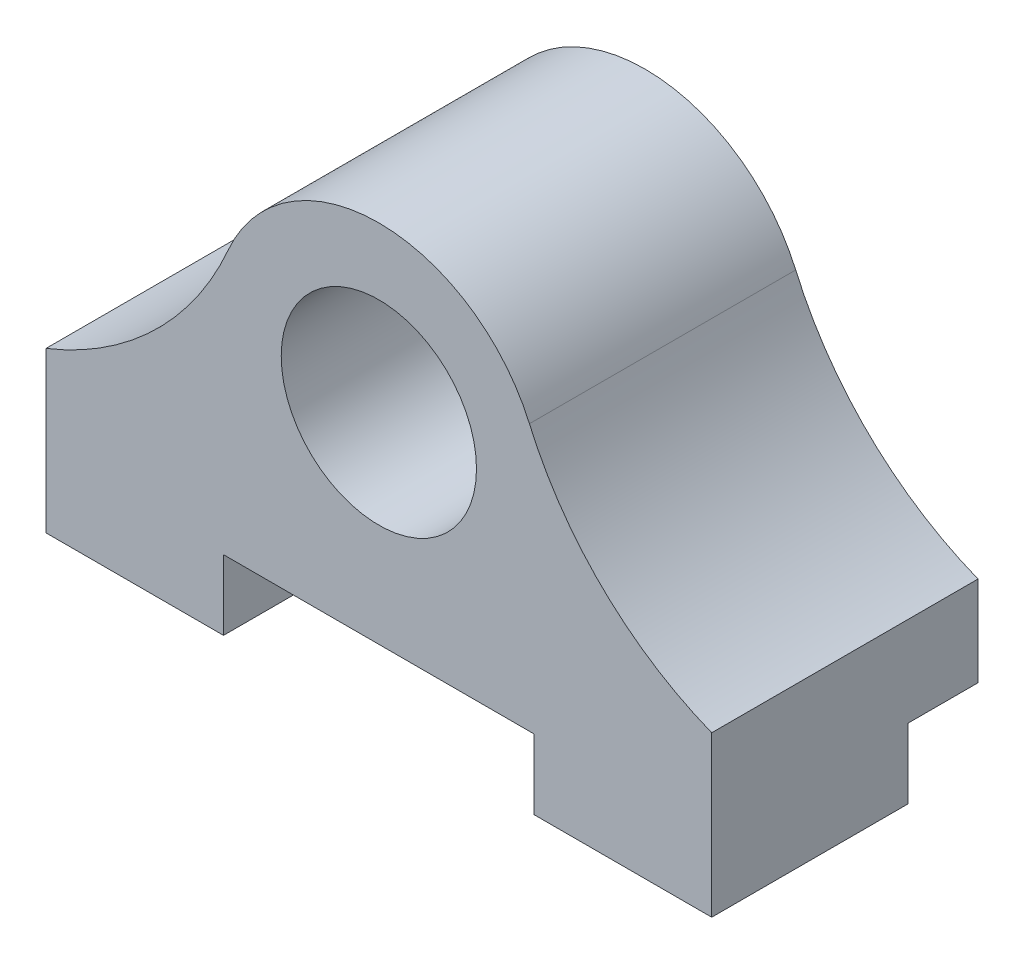
ISO-10303-21;
HEADER;
FILE_DESCRIPTION(('STEP AP214'),'2;1');
FILE_NAME('part.step','',(''),(''),'','','');
FILE_SCHEMA(('AUTOMOTIVE_DESIGN { 1 0 10303 214 1 1 1 1 }'));
ENDSEC;
DATA;
#1=APPLICATION_CONTEXT('core data for automotive mechanical design processes');
#2=APPLICATION_PROTOCOL_DEFINITION('international standard','automotive_design',2000,#1);
#3=PRODUCT_CONTEXT('',#1,'mechanical');
#4=PRODUCT('Part','Part','',(#3));
#5=PRODUCT_RELATED_PRODUCT_CATEGORY('part','',(#4));
#6=PRODUCT_DEFINITION_FORMATION('','',#4);
#7=PRODUCT_DEFINITION_CONTEXT('part definition',#1,'design');
#8=PRODUCT_DEFINITION('design','',#6,#7);
#9=PRODUCT_DEFINITION_SHAPE('','',#8);
#10=(LENGTH_UNIT() NAMED_UNIT(*) SI_UNIT(.MILLI.,.METRE.));
#11=(NAMED_UNIT(*) PLANE_ANGLE_UNIT() SI_UNIT($,.RADIAN.));
#12=(NAMED_UNIT(*) SI_UNIT($,.STERADIAN.) SOLID_ANGLE_UNIT());
#13=UNCERTAINTY_MEASURE_WITH_UNIT(LENGTH_MEASURE(1.E-05),#10,'distance_accuracy_value','');
#14=(GEOMETRIC_REPRESENTATION_CONTEXT(3) GLOBAL_UNCERTAINTY_ASSIGNED_CONTEXT((#13)) GLOBAL_UNIT_ASSIGNED_CONTEXT((#10,
#11,#12)) REPRESENTATION_CONTEXT('',''));
#15=CARTESIAN_POINT('',(0.,0.,0.));
#16=DIRECTION('',(0.,0.,1.));
#17=DIRECTION('',(1.,0.,0.));
#18=AXIS2_PLACEMENT_3D('',#15,#16,#17);
#19=CARTESIAN_POINT('',(0.,-12.2,0.));
#20=DIRECTION('',(0.,-1.,0.));
#21=DIRECTION('',(0.,0.,-1.));
#22=AXIS2_PLACEMENT_3D('',#19,#20,#21);
#23=PLANE('',#22);
#24=DIRECTION('',(0.,0.,1.));
#25=VECTOR('',#24,1.);
#26=CARTESIAN_POINT('',(6.99999999999999,-12.2,-2.));
#27=LINE('',#26,#25);
#28=CARTESIAN_POINT('',(6.99999999999999,-12.2,1.15));
#29=VERTEX_POINT('',#28);
#30=CARTESIAN_POINT('',(6.99999999999999,-12.2,10.));
#31=VERTEX_POINT('',#30);
#32=EDGE_CURVE('E139',#29,#31,#27,.T.);
#33=ORIENTED_EDGE('',*,*,#32,.F.);
#34=DIRECTION('',(-1.,0.,0.));
#35=VECTOR('',#34,1.);
#36=CARTESIAN_POINT('',(15.,-12.2,1.15));
#37=LINE('',#36,#35);
#38=CARTESIAN_POINT('',(15.,-12.2,1.15));
#39=VERTEX_POINT('',#38);
#40=EDGE_CURVE('E160',#39,#29,#37,.T.);
#41=ORIENTED_EDGE('',*,*,#40,.F.);
#42=DIRECTION('',(0.,0.,1.));
#43=VECTOR('',#42,1.);
#44=CARTESIAN_POINT('',(15.,-12.2,10.));
#45=LINE('',#44,#43);
#46=CARTESIAN_POINT('',(15.,-12.2,10.));
#47=VERTEX_POINT('',#46);
#48=EDGE_CURVE('E190',#39,#47,#45,.T.);
#49=ORIENTED_EDGE('',*,*,#48,.T.);
#50=DIRECTION('',(-1.,0.,0.));
#51=VECTOR('',#50,1.);
#52=CARTESIAN_POINT('',(-15.,-12.2,10.));
#53=LINE('',#52,#51);
#54=EDGE_CURVE('E192',#47,#31,#53,.T.);
#55=ORIENTED_EDGE('',*,*,#54,.T.);
#56=EDGE_LOOP('',(#33,#41,#49,#55));
#57=FACE_BOUND('',#56,.T.);
#58=CARTESIAN_POINT('',(11.5,-12.2,4.));
#59=DIRECTION('',(0.,-1.,0.));
#60=DIRECTION('',(0.,0.,-1.));
#61=AXIS2_PLACEMENT_3D('',#58,#59,#60);
#62=CIRCLE('',#61,1.65);
#63=CARTESIAN_POINT('',(11.5,-12.2,2.35));
#64=VERTEX_POINT('',#63);
#65=EDGE_CURVE('E183',#64,#64,#62,.T.);
#66=ORIENTED_EDGE('',*,*,#65,.F.);
#67=EDGE_LOOP('',(#66));
#68=FACE_BOUND('',#67,.T.);
#69=ADVANCED_FACE('F41',(#57,#68),#23,.T.);
#70=CARTESIAN_POINT('',(0.,0.,1.15));
#71=DIRECTION('',(0.,0.,1.));
#72=DIRECTION('',(1.,0.,0.));
#73=AXIS2_PLACEMENT_3D('',#70,#71,#72);
#74=PLANE('',#73);
#75=ORIENTED_EDGE('',*,*,#40,.T.);
#76=DIRECTION('',(0.,1.,0.));
#77=VECTOR('',#76,1.);
#78=CARTESIAN_POINT('',(6.99999999999999,0.,1.15));
#79=LINE('',#78,#77);
#80=CARTESIAN_POINT('',(6.99999999999999,-9.05,1.15));
#81=VERTEX_POINT('',#80);
#82=EDGE_CURVE('E11',#29,#81,#79,.T.);
#83=ORIENTED_EDGE('',*,*,#82,.T.);
#84=DIRECTION('',(1.,0.,0.));
#85=VECTOR('',#84,1.);
#86=CARTESIAN_POINT('',(15.,-9.05,1.15));
#87=LINE('',#86,#85);
#88=CARTESIAN_POINT('',(15.,-9.05,1.15));
#89=VERTEX_POINT('',#88);
#90=EDGE_CURVE('E164',#81,#89,#87,.T.);
#91=ORIENTED_EDGE('',*,*,#90,.T.);
#92=DIRECTION('',(0.,-1.,0.));
#93=VECTOR('',#92,1.);
#94=CARTESIAN_POINT('',(15.,-12.2,1.15));
#95=LINE('',#94,#93);
#96=EDGE_CURVE('E64',#89,#39,#95,.T.);
#97=ORIENTED_EDGE('',*,*,#96,.T.);
#98=EDGE_LOOP('',(#75,#83,#91,#97));
#99=FACE_BOUND('',#98,.T.);
#100=ADVANCED_FACE('F270',(#99),#74,.F.);
#101=CARTESIAN_POINT('',(0.,0.,-2.));
#102=DIRECTION('',(0.,0.,1.));
#103=DIRECTION('',(1.,0.,0.));
#104=AXIS2_PLACEMENT_3D('',#101,#102,#103);
#105=PLANE('',#104);
#106=DIRECTION('',(1.,0.,0.));
#107=VECTOR('',#106,1.);
#108=CARTESIAN_POINT('',(0.,-9.05,-2.));
#109=LINE('',#108,#107);
#110=CARTESIAN_POINT('',(-15.,-9.05,-2.));
#111=VERTEX_POINT('',#110);
#112=CARTESIAN_POINT('',(15.,-9.05,-2.));
#113=VERTEX_POINT('',#112);
#114=EDGE_CURVE('E173',#111,#113,#109,.T.);
#115=ORIENTED_EDGE('',*,*,#114,.F.);
#116=DIRECTION('',(0.,1.,0.));
#117=VECTOR('',#116,1.);
#118=CARTESIAN_POINT('',(-15.,-12.2,-2.));
#119=LINE('',#118,#117);
#120=CARTESIAN_POINT('',(-15.,-5.,-2.));
#121=VERTEX_POINT('',#120);
#122=EDGE_CURVE('E201',#111,#121,#119,.T.);
#123=ORIENTED_EDGE('',*,*,#122,.T.);
#124=CARTESIAN_POINT('',(-20.5386621432639,8.93998642979166,-2.));
#125=DIRECTION('',(0.,0.,1.));
#126=DIRECTION('',(1.,0.,0.));
#127=AXIS2_PLACEMENT_3D('',#124,#125,#126);
#128=CIRCLE('',#127,15.);
#129=CARTESIAN_POINT('',(-6.78509374375682,2.9533883741276,-2.));
#130=VERTEX_POINT('',#129);
#131=EDGE_CURVE('E206',#130,#121,#128,.F.);
#132=ORIENTED_EDGE('',*,*,#131,.F.);
#133=CARTESIAN_POINT('',(0.,0.,-2.));
#134=DIRECTION('',(0.,0.,1.));
#135=DIRECTION('',(1.,0.,0.));
#136=AXIS2_PLACEMENT_3D('',#133,#134,#135);
#137=CIRCLE('',#136,7.4);
#138=CARTESIAN_POINT('',(6.78509374375682,2.9533883741276,-2.));
#139=VERTEX_POINT('',#138);
#140=EDGE_CURVE('E203',#130,#139,#137,.F.);
#141=ORIENTED_EDGE('',*,*,#140,.T.);
#142=CARTESIAN_POINT('',(20.5386621432639,8.93998642979166,-2.));
#143=DIRECTION('',(0.,0.,1.));
#144=DIRECTION('',(1.,0.,0.));
#145=AXIS2_PLACEMENT_3D('',#142,#143,#144);
#146=CIRCLE('',#145,15.);
#147=CARTESIAN_POINT('',(15.,-5.,-2.));
#148=VERTEX_POINT('',#147);
#149=EDGE_CURVE('E209',#139,#148,#146,.T.);
#150=ORIENTED_EDGE('',*,*,#149,.T.);
#151=DIRECTION('',(0.,1.,0.));
#152=VECTOR('',#151,1.);
#153=CARTESIAN_POINT('',(15.,-12.2,-2.));
#154=LINE('',#153,#152);
#155=EDGE_CURVE('E199',#113,#148,#154,.T.);
#156=ORIENTED_EDGE('',*,*,#155,.F.);
#157=EDGE_LOOP('',(#115,#123,#132,#141,#150,#156));
#158=FACE_BOUND('',#157,.T.);
#159=ADVANCED_FACE('F249',(#158),#105,.F.);
#160=CARTESIAN_POINT('',(-15.,-12.2,10.));
#161=DIRECTION('',(1.,0.,0.));
#162=DIRECTION('',(0.,0.,-1.));
#163=AXIS2_PLACEMENT_3D('',#160,#161,#162);
#164=PLANE('',#163);
#165=DIRECTION('',(0.,0.,1.));
#166=VECTOR('',#165,1.);
#167=CARTESIAN_POINT('',(-15.,-9.05,-2.000012));
#168=LINE('',#167,#166);
#169=CARTESIAN_POINT('',(-15.,-9.05,1.15));
#170=VERTEX_POINT('',#169);
#171=EDGE_CURVE('E170',#111,#170,#168,.T.);
#172=ORIENTED_EDGE('',*,*,#171,.T.);
#173=DIRECTION('',(0.,1.,0.));
#174=VECTOR('',#173,1.);
#175=CARTESIAN_POINT('',(-15.,-12.2,1.15));
#176=LINE('',#175,#174);
#177=CARTESIAN_POINT('',(-15.,-12.2,1.15));
#178=VERTEX_POINT('',#177);
#179=EDGE_CURVE('E162',#178,#170,#176,.T.);
#180=ORIENTED_EDGE('',*,*,#179,.F.);
#181=DIRECTION('',(0.,0.,-1.));
#182=VECTOR('',#181,1.);
#183=CARTESIAN_POINT('',(-15.,-12.2,10.));
#184=LINE('',#183,#182);
#185=CARTESIAN_POINT('',(-15.,-12.2,10.));
#186=VERTEX_POINT('',#185);
#187=EDGE_CURVE('E179',#186,#178,#184,.T.);
#188=ORIENTED_EDGE('',*,*,#187,.F.);
#189=DIRECTION('',(0.,1.,0.));
#190=VECTOR('',#189,1.);
#191=CARTESIAN_POINT('',(-15.,-12.2,10.));
#192=LINE('',#191,#190);
#193=CARTESIAN_POINT('',(-15.,-5.,10.));
#194=VERTEX_POINT('',#193);
#195=EDGE_CURVE('E195',#186,#194,#192,.T.);
#196=ORIENTED_EDGE('',*,*,#195,.T.);
#197=DIRECTION('',(0.,0.,-1.));
#198=VECTOR('',#197,1.);
#199=CARTESIAN_POINT('',(-15.,-5.,10.));
#200=LINE('',#199,#198);
#201=EDGE_CURVE('E232',#194,#121,#200,.T.);
#202=ORIENTED_EDGE('',*,*,#201,.T.);
#203=ORIENTED_EDGE('',*,*,#122,.F.);
#204=EDGE_LOOP('',(#172,#180,#188,#196,#202,#203));
#205=FACE_BOUND('',#204,.T.);
#206=ADVANCED_FACE('F243',(#205),#164,.F.);
#207=CARTESIAN_POINT('',(15.,-12.2,10.));
#208=DIRECTION('',(-1.,0.,0.));
#209=DIRECTION('',(0.,0.,1.));
#210=AXIS2_PLACEMENT_3D('',#207,#208,#209);
#211=PLANE('',#210);
#212=DIRECTION('',(0.,0.,1.));
#213=VECTOR('',#212,1.);
#214=CARTESIAN_POINT('',(15.,-9.05,-2.000012));
#215=LINE('',#214,#213);
#216=EDGE_CURVE('E167',#113,#89,#215,.T.);
#217=ORIENTED_EDGE('',*,*,#216,.F.);
#218=ORIENTED_EDGE('',*,*,#155,.T.);
#219=DIRECTION('',(0.,0.,-1.));
#220=VECTOR('',#219,1.);
#221=CARTESIAN_POINT('',(15.,-5.,10.));
#222=LINE('',#221,#220);
#223=CARTESIAN_POINT('',(15.,-5.,10.));
#224=VERTEX_POINT('',#223);
#225=EDGE_CURVE('E229',#224,#148,#222,.T.);
#226=ORIENTED_EDGE('',*,*,#225,.F.);
#227=DIRECTION('',(0.,1.,0.));
#228=VECTOR('',#227,1.);
#229=CARTESIAN_POINT('',(15.,-12.2,10.));
#230=LINE('',#229,#228);
#231=EDGE_CURVE('E197',#47,#224,#230,.T.);
#232=ORIENTED_EDGE('',*,*,#231,.F.);
#233=ORIENTED_EDGE('',*,*,#48,.F.);
#234=ORIENTED_EDGE('',*,*,#96,.F.);
#235=EDGE_LOOP('',(#217,#218,#226,#232,#233,#234));
#236=FACE_BOUND('',#235,.T.);
#237=ADVANCED_FACE('F267',(#236),#211,.F.);
#238=CARTESIAN_POINT('',(-20.5386621432639,8.93998642979166,10.));
#239=DIRECTION('',(0.,0.,-1.));
#240=DIRECTION('',(-1.,0.,0.));
#241=AXIS2_PLACEMENT_3D('',#238,#239,#240);
#242=PLANE('',#241);
#243=DIRECTION('',(1.,0.,0.));
#244=VECTOR('',#243,1.);
#245=CARTESIAN_POINT('',(-20.5386621432639,-9.05,10.));
#246=LINE('',#245,#244);
#247=CARTESIAN_POINT('',(-7.00000000000001,-9.05,10.));
#248=VERTEX_POINT('',#247);
#249=CARTESIAN_POINT('',(6.99999999999999,-9.05,10.));
#250=VERTEX_POINT('',#249);
#251=EDGE_CURVE('E131',#248,#250,#246,.T.);
#252=ORIENTED_EDGE('',*,*,#251,.T.);
#253=DIRECTION('',(0.,-1.,0.));
#254=VECTOR('',#253,1.);
#255=CARTESIAN_POINT('',(7.,8.93998642979166,10.));
#256=LINE('',#255,#254);
#257=EDGE_CURVE('E153',#250,#31,#256,.T.);
#258=ORIENTED_EDGE('',*,*,#257,.T.);
#259=ORIENTED_EDGE('',*,*,#54,.F.);
#260=ORIENTED_EDGE('',*,*,#231,.T.);
#261=CARTESIAN_POINT('',(20.5386621432639,8.93998642979166,10.));
#262=DIRECTION('',(0.,0.,-1.));
#263=DIRECTION('',(1.,0.,0.));
#264=AXIS2_PLACEMENT_3D('',#261,#262,#263);
#265=CIRCLE('',#264,15.);
#266=CARTESIAN_POINT('',(6.78509374375682,2.9533883741276,10.));
#267=VERTEX_POINT('',#266);
#268=EDGE_CURVE('E221',#224,#267,#265,.T.);
#269=ORIENTED_EDGE('',*,*,#268,.T.);
#270=CARTESIAN_POINT('',(0.,0.,10.));
#271=DIRECTION('',(0.,0.,1.));
#272=DIRECTION('',(-1.,0.,0.));
#273=AXIS2_PLACEMENT_3D('',#270,#271,#272);
#274=CIRCLE('',#273,7.4);
#275=CARTESIAN_POINT('',(-6.78509374375682,2.9533883741276,10.));
#276=VERTEX_POINT('',#275);
#277=EDGE_CURVE('E223',#267,#276,#274,.T.);
#278=ORIENTED_EDGE('',*,*,#277,.T.);
#279=CARTESIAN_POINT('',(-20.5386621432639,8.93998642979166,10.));
#280=DIRECTION('',(0.,0.,-1.));
#281=DIRECTION('',(-1.,0.,0.));
#282=AXIS2_PLACEMENT_3D('',#279,#280,#281);
#283=CIRCLE('',#282,15.);
#284=EDGE_CURVE('E216',#276,#194,#283,.T.);
#285=ORIENTED_EDGE('',*,*,#284,.T.);
#286=ORIENTED_EDGE('',*,*,#195,.F.);
#287=CARTESIAN_POINT('',(-7.00000000000001,-12.2,10.));
#288=VERTEX_POINT('',#287);
#289=EDGE_CURVE('E152',#288,#186,#53,.T.);
#290=ORIENTED_EDGE('',*,*,#289,.F.);
#291=DIRECTION('',(0.,1.,0.));
#292=VECTOR('',#291,1.);
#293=CARTESIAN_POINT('',(-7.,8.93998642979165,10.));
#294=LINE('',#293,#292);
#295=EDGE_CURVE('E138',#288,#248,#294,.T.);
#296=ORIENTED_EDGE('',*,*,#295,.T.);
#297=EDGE_LOOP('',(#252,#258,#259,#260,#269,#278,#285,#286,#290,#296));
#298=FACE_BOUND('',#297,.T.);
#299=CARTESIAN_POINT('',(0.,0.,10.));
#300=DIRECTION('',(0.,0.,1.));
#301=DIRECTION('',(1.,0.,0.));
#302=AXIS2_PLACEMENT_3D('',#299,#300,#301);
#303=CIRCLE('',#302,4.4);
#304=CARTESIAN_POINT('',(4.4,0.,10.));
#305=VERTEX_POINT('',#304);
#306=EDGE_CURVE('E213',#305,#305,#303,.T.);
#307=ORIENTED_EDGE('',*,*,#306,.F.);
#308=EDGE_LOOP('',(#307));
#309=FACE_BOUND('',#308,.T.);
#310=ADVANCED_FACE('F149',(#298,#309),#242,.F.);
#311=CARTESIAN_POINT('',(-20.5386621432639,8.93998642979166,10.));
#312=DIRECTION('',(0.,0.,-1.));
#313=DIRECTION('',(-1.,0.,0.));
#314=AXIS2_PLACEMENT_3D('',#311,#312,#313);
#315=CYLINDRICAL_SURFACE('',#314,15.);
#316=DIRECTION('',(0.,0.,-1.));
#317=VECTOR('',#316,1.);
#318=CARTESIAN_POINT('',(-6.78509374375682,2.9533883741276,10.));
#319=LINE('',#318,#317);
#320=EDGE_CURVE('E225',#276,#130,#319,.T.);
#321=ORIENTED_EDGE('',*,*,#320,.T.);
#322=ORIENTED_EDGE('',*,*,#131,.T.);
#323=ORIENTED_EDGE('',*,*,#201,.F.);
#324=ORIENTED_EDGE('',*,*,#284,.F.);
#325=EDGE_LOOP('',(#321,#322,#323,#324));
#326=FACE_BOUND('',#325,.T.);
#327=ADVANCED_FACE('F43',(#326),#315,.F.);
#328=CARTESIAN_POINT('',(20.5386621432639,8.93998642979166,10.));
#329=DIRECTION('',(0.,0.,-1.));
#330=DIRECTION('',(-1.,0.,0.));
#331=AXIS2_PLACEMENT_3D('',#328,#329,#330);
#332=CYLINDRICAL_SURFACE('',#331,15.);
#333=ORIENTED_EDGE('',*,*,#225,.T.);
#334=ORIENTED_EDGE('',*,*,#149,.F.);
#335=DIRECTION('',(0.,0.,-1.));
#336=VECTOR('',#335,1.);
#337=CARTESIAN_POINT('',(6.78509374375682,2.9533883741276,10.));
#338=LINE('',#337,#336);
#339=EDGE_CURVE('E227',#267,#139,#338,.T.);
#340=ORIENTED_EDGE('',*,*,#339,.F.);
#341=ORIENTED_EDGE('',*,*,#268,.F.);
#342=EDGE_LOOP('',(#333,#334,#340,#341));
#343=FACE_BOUND('',#342,.T.);
#344=ADVANCED_FACE('F263',(#343),#332,.F.);
#345=CARTESIAN_POINT('',(0.,0.,10.));
#346=DIRECTION('',(0.,0.,-1.));
#347=DIRECTION('',(-1.,0.,0.));
#348=AXIS2_PLACEMENT_3D('',#345,#346,#347);
#349=CYLINDRICAL_SURFACE('',#348,7.4);
#350=ORIENTED_EDGE('',*,*,#339,.T.);
#351=ORIENTED_EDGE('',*,*,#140,.F.);
#352=ORIENTED_EDGE('',*,*,#320,.F.);
#353=ORIENTED_EDGE('',*,*,#277,.F.);
#354=EDGE_LOOP('',(#350,#351,#352,#353));
#355=FACE_BOUND('',#354,.T.);
#356=ADVANCED_FACE('F258',(#355),#349,.T.);
#357=CARTESIAN_POINT('',(0.,0.,10.));
#358=DIRECTION('',(0.,0.,-1.));
#359=DIRECTION('',(-1.,0.,0.));
#360=AXIS2_PLACEMENT_3D('',#357,#358,#359);
#361=CYLINDRICAL_SURFACE('',#360,4.4);
#362=ORIENTED_EDGE('',*,*,#306,.T.);
#363=EDGE_LOOP('',(#362));
#364=FACE_BOUND('',#363,.T.);
#365=CARTESIAN_POINT('',(0.,0.,0.));
#366=DIRECTION('',(0.,0.,1.));
#367=DIRECTION('',(1.,0.,0.));
#368=AXIS2_PLACEMENT_3D('',#365,#366,#367);
#369=CIRCLE('',#368,4.4);
#370=CARTESIAN_POINT('',(4.4,0.,0.));
#371=VERTEX_POINT('',#370);
#372=EDGE_CURVE('E212',#371,#371,#369,.T.);
#373=ORIENTED_EDGE('',*,*,#372,.F.);
#374=EDGE_LOOP('',(#373));
#375=FACE_BOUND('',#374,.T.);
#376=ADVANCED_FACE('F308',(#364,#375),#361,.F.);
#377=CARTESIAN_POINT('',(0.,0.,0.));
#378=DIRECTION('',(0.,0.,1.));
#379=DIRECTION('',(1.,0.,0.));
#380=AXIS2_PLACEMENT_3D('',#377,#378,#379);
#381=PLANE('',#380);
#382=ORIENTED_EDGE('',*,*,#372,.T.);
#383=EDGE_LOOP('',(#382));
#384=FACE_BOUND('',#383,.T.);
#385=ADVANCED_FACE('F295',(#384),#381,.T.);
#386=DIRECTION('',(0.,0.,1.));
#387=VECTOR('',#386,1.);
#388=CARTESIAN_POINT('',(-7.00000000000001,-12.2,-2.));
#389=LINE('',#388,#387);
#390=CARTESIAN_POINT('',(-7.00000000000001,-12.2,1.15));
#391=VERTEX_POINT('',#390);
#392=EDGE_CURVE('E146',#391,#288,#389,.T.);
#393=ORIENTED_EDGE('',*,*,#392,.T.);
#394=ORIENTED_EDGE('',*,*,#289,.T.);
#395=ORIENTED_EDGE('',*,*,#187,.T.);
#396=EDGE_CURVE('E159',#391,#178,#37,.T.);
#397=ORIENTED_EDGE('',*,*,#396,.F.);
#398=EDGE_LOOP('',(#393,#394,#395,#397));
#399=FACE_BOUND('',#398,.T.);
#400=CARTESIAN_POINT('',(-11.5,-12.2,4.));
#401=DIRECTION('',(0.,-1.,0.));
#402=DIRECTION('',(0.,0.,-1.));
#403=AXIS2_PLACEMENT_3D('',#400,#401,#402);
#404=CIRCLE('',#403,1.65);
#405=CARTESIAN_POINT('',(-11.5,-12.2,2.35));
#406=VERTEX_POINT('',#405);
#407=EDGE_CURVE('E180',#406,#406,#404,.T.);
#408=ORIENTED_EDGE('',*,*,#407,.F.);
#409=EDGE_LOOP('',(#408));
#410=FACE_BOUND('',#409,.T.);
#411=ADVANCED_FACE('F239',(#399,#410),#23,.T.);
#412=CARTESIAN_POINT('',(11.5,-4.2,4.));
#413=DIRECTION('',(0.,-1.,0.));
#414=DIRECTION('',(0.,0.,-1.));
#415=AXIS2_PLACEMENT_3D('',#412,#413,#414);
#416=CYLINDRICAL_SURFACE('',#415,1.65);
#417=CARTESIAN_POINT('',(11.5,-4.2,4.));
#418=DIRECTION('',(0.,-1.,0.));
#419=DIRECTION('',(0.,0.,-1.));
#420=AXIS2_PLACEMENT_3D('',#417,#418,#419);
#421=CIRCLE('',#420,1.65);
#422=CARTESIAN_POINT('',(11.5,-4.2,2.35));
#423=VERTEX_POINT('',#422);
#424=EDGE_CURVE('E175',#423,#423,#421,.T.);
#425=ORIENTED_EDGE('',*,*,#424,.F.);
#426=EDGE_LOOP('',(#425));
#427=FACE_BOUND('',#426,.T.);
#428=ORIENTED_EDGE('',*,*,#65,.T.);
#429=EDGE_LOOP('',(#428));
#430=FACE_BOUND('',#429,.T.);
#431=ADVANCED_FACE('F282',(#427,#430),#416,.F.);
#432=CARTESIAN_POINT('',(11.5,-4.2,4.));
#433=DIRECTION('',(0.,-1.,0.));
#434=DIRECTION('',(0.,0.,-1.));
#435=AXIS2_PLACEMENT_3D('',#432,#433,#434);
#436=PLANE('',#435);
#437=ORIENTED_EDGE('',*,*,#424,.T.);
#438=EDGE_LOOP('',(#437));
#439=FACE_BOUND('',#438,.T.);
#440=ADVANCED_FACE('F284',(#439),#436,.T.);
#441=CARTESIAN_POINT('',(-11.5,-4.2,4.));
#442=DIRECTION('',(0.,-1.,0.));
#443=DIRECTION('',(0.,0.,-1.));
#444=AXIS2_PLACEMENT_3D('',#441,#442,#443);
#445=CYLINDRICAL_SURFACE('',#444,1.65);
#446=CARTESIAN_POINT('',(-11.5,-4.2,4.));
#447=DIRECTION('',(0.,-1.,0.));
#448=DIRECTION('',(0.,0.,-1.));
#449=AXIS2_PLACEMENT_3D('',#446,#447,#448);
#450=CIRCLE('',#449,1.65);
#451=CARTESIAN_POINT('',(-11.5,-4.2,2.35));
#452=VERTEX_POINT('',#451);
#453=EDGE_CURVE('E176',#452,#452,#450,.T.);
#454=ORIENTED_EDGE('',*,*,#453,.F.);
#455=EDGE_LOOP('',(#454));
#456=FACE_BOUND('',#455,.T.);
#457=ORIENTED_EDGE('',*,*,#407,.T.);
#458=EDGE_LOOP('',(#457));
#459=FACE_BOUND('',#458,.T.);
#460=ADVANCED_FACE('F291',(#456,#459),#445,.F.);
#461=CARTESIAN_POINT('',(-11.5,-4.2,4.));
#462=DIRECTION('',(0.,-1.,0.));
#463=DIRECTION('',(0.,0.,-1.));
#464=AXIS2_PLACEMENT_3D('',#461,#462,#463);
#465=PLANE('',#464);
#466=ORIENTED_EDGE('',*,*,#453,.T.);
#467=EDGE_LOOP('',(#466));
#468=FACE_BOUND('',#467,.T.);
#469=ADVANCED_FACE('F387',(#468),#465,.T.);
#470=CARTESIAN_POINT('',(15.,-9.05,-2.000012));
#471=DIRECTION('',(0.,-1.,0.));
#472=DIRECTION('',(0.,0.,-1.));
#473=AXIS2_PLACEMENT_3D('',#470,#471,#472);
#474=PLANE('',#473);
#475=ORIENTED_EDGE('',*,*,#114,.T.);
#476=ORIENTED_EDGE('',*,*,#216,.T.);
#477=ORIENTED_EDGE('',*,*,#90,.F.);
#478=DIRECTION('',(0.,0.,1.));
#479=VECTOR('',#478,1.);
#480=CARTESIAN_POINT('',(6.99999999999999,-9.05,-2.));
#481=LINE('',#480,#479);
#482=EDGE_CURVE('E134',#81,#250,#481,.T.);
#483=ORIENTED_EDGE('',*,*,#482,.T.);
#484=ORIENTED_EDGE('',*,*,#251,.F.);
#485=DIRECTION('',(0.,0.,1.));
#486=VECTOR('',#485,1.);
#487=CARTESIAN_POINT('',(-7.00000000000001,-9.05,-2.));
#488=LINE('',#487,#486);
#489=CARTESIAN_POINT('',(-7.00000000000001,-9.05,1.15));
#490=VERTEX_POINT('',#489);
#491=EDGE_CURVE('E56',#490,#248,#488,.T.);
#492=ORIENTED_EDGE('',*,*,#491,.F.);
#493=EDGE_CURVE('E165',#170,#490,#87,.T.);
#494=ORIENTED_EDGE('',*,*,#493,.F.);
#495=ORIENTED_EDGE('',*,*,#171,.F.);
#496=EDGE_LOOP('',(#475,#476,#477,#483,#484,#492,#494,#495));
#497=FACE_BOUND('',#496,.T.);
#498=ADVANCED_FACE('F132',(#497),#474,.T.);
#499=ORIENTED_EDGE('',*,*,#493,.T.);
#500=DIRECTION('',(0.,-1.,0.));
#501=VECTOR('',#500,1.);
#502=CARTESIAN_POINT('',(-7.,0.,1.15));
#503=LINE('',#502,#501);
#504=EDGE_CURVE('E49',#490,#391,#503,.T.);
#505=ORIENTED_EDGE('',*,*,#504,.T.);
#506=ORIENTED_EDGE('',*,*,#396,.T.);
#507=ORIENTED_EDGE('',*,*,#179,.T.);
#508=EDGE_LOOP('',(#499,#505,#506,#507));
#509=FACE_BOUND('',#508,.T.);
#510=ADVANCED_FACE('F236',(#509),#74,.F.);
#511=CARTESIAN_POINT('',(6.99999999999999,-12.2,-2.));
#512=DIRECTION('',(1.,0.,0.));
#513=DIRECTION('',(0.,0.,-1.));
#514=AXIS2_PLACEMENT_3D('',#511,#512,#513);
#515=PLANE('',#514);
#516=ORIENTED_EDGE('',*,*,#482,.F.);
#517=ORIENTED_EDGE('',*,*,#82,.F.);
#518=ORIENTED_EDGE('',*,*,#32,.T.);
#519=ORIENTED_EDGE('',*,*,#257,.F.);
#520=EDGE_LOOP('',(#516,#517,#518,#519));
#521=FACE_BOUND('',#520,.T.);
#522=ADVANCED_FACE('F273',(#521),#515,.F.);
#523=CARTESIAN_POINT('',(-7.00000000000001,-12.2,-2.));
#524=DIRECTION('',(-1.,0.,0.));
#525=DIRECTION('',(0.,-1.,0.));
#526=AXIS2_PLACEMENT_3D('',#523,#524,#525);
#527=PLANE('',#526);
#528=ORIENTED_EDGE('',*,*,#392,.F.);
#529=ORIENTED_EDGE('',*,*,#504,.F.);
#530=ORIENTED_EDGE('',*,*,#491,.T.);
#531=ORIENTED_EDGE('',*,*,#295,.F.);
#532=EDGE_LOOP('',(#528,#529,#530,#531));
#533=FACE_BOUND('',#532,.T.);
#534=ADVANCED_FACE('F142',(#533),#527,.F.);
#535=CLOSED_SHELL('',(#69,#100,#159,#206,#237,#310,#327,#344,#356,#376,#385,#411,#431,#440,#460,
#469,#498,#510,#522,#534));
#536=MANIFOLD_SOLID_BREP('B2',#535);
#537=ADVANCED_BREP_SHAPE_REPRESENTATION('',(#18,#536),#14);
#538=SHAPE_DEFINITION_REPRESENTATION(#9,#537);
ENDSEC;
END-ISO-10303-21;
